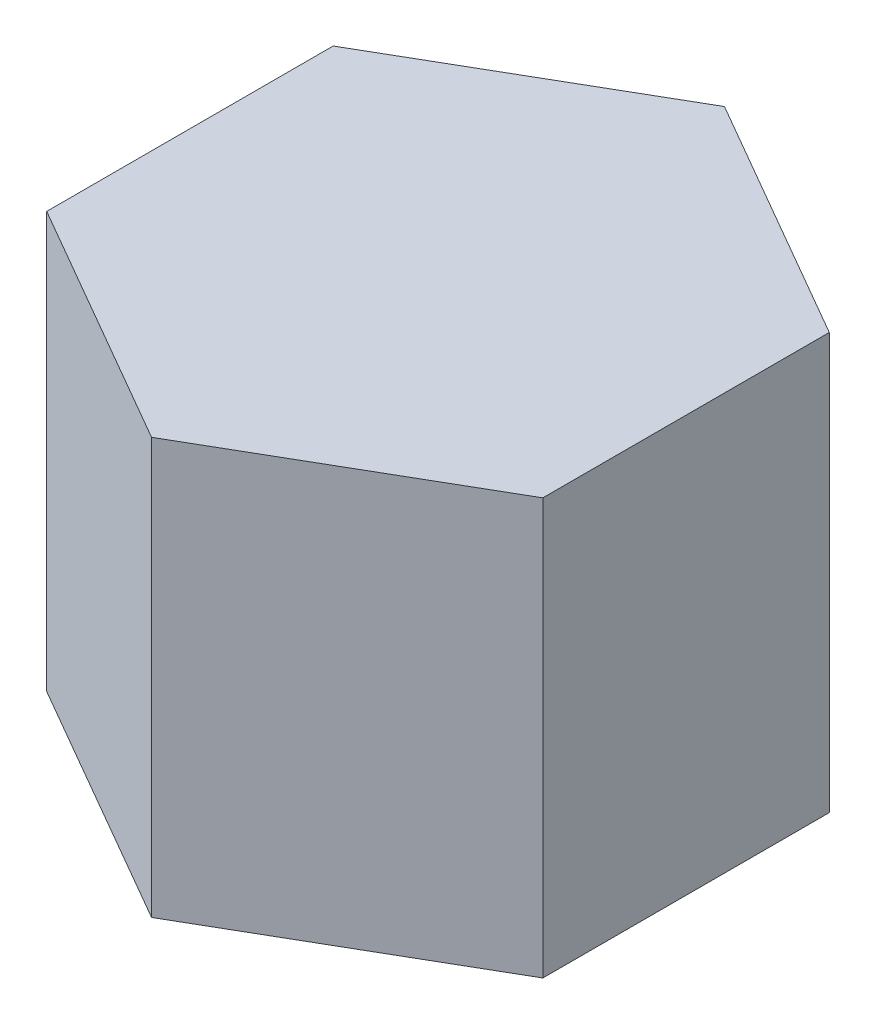
ISO-10303-21;
HEADER;
FILE_DESCRIPTION(('STEP AP214'),'2;1');
FILE_NAME('part.step','',(''),(''),'','','');
FILE_SCHEMA(('AUTOMOTIVE_DESIGN { 1 0 10303 214 1 1 1 1 }'));
ENDSEC;
DATA;
#1=APPLICATION_CONTEXT('core data for automotive mechanical design processes');
#2=APPLICATION_PROTOCOL_DEFINITION('international standard','automotive_design',2000,#1);
#3=PRODUCT_CONTEXT('',#1,'mechanical');
#4=PRODUCT('Part','Part','',(#3));
#5=PRODUCT_RELATED_PRODUCT_CATEGORY('part','',(#4));
#6=PRODUCT_DEFINITION_FORMATION('','',#4);
#7=PRODUCT_DEFINITION_CONTEXT('part definition',#1,'design');
#8=PRODUCT_DEFINITION('design','',#6,#7);
#9=PRODUCT_DEFINITION_SHAPE('','',#8);
#10=(LENGTH_UNIT() NAMED_UNIT(*) SI_UNIT(.MILLI.,.METRE.));
#11=(NAMED_UNIT(*) PLANE_ANGLE_UNIT() SI_UNIT($,.RADIAN.));
#12=(NAMED_UNIT(*) SI_UNIT($,.STERADIAN.) SOLID_ANGLE_UNIT());
#13=UNCERTAINTY_MEASURE_WITH_UNIT(LENGTH_MEASURE(1.E-05),#10,'distance_accuracy_value','');
#14=(GEOMETRIC_REPRESENTATION_CONTEXT(3) GLOBAL_UNCERTAINTY_ASSIGNED_CONTEXT((#13)) GLOBAL_UNIT_ASSIGNED_CONTEXT((#10,
#11,#12)) REPRESENTATION_CONTEXT('',''));
#15=CARTESIAN_POINT('',(0.,0.,0.));
#16=DIRECTION('',(0.,0.,1.));
#17=DIRECTION('',(1.,0.,0.));
#18=AXIS2_PLACEMENT_3D('',#15,#16,#17);
#19=CARTESIAN_POINT('',(209.142660308706,-148.537700895744,294.105047431848));
#20=DIRECTION('',(-0.499999999999909,0.,-0.866025403784491));
#21=DIRECTION('',(-0.866025403784491,0.,0.499999999999909));
#22=AXIS2_PLACEMENT_3D('',#19,#20,#21);
#23=PLANE('',#22);
#24=CARTESIAN_POINT('',(208.839551417381,-149.045793579175,294.280047431848));
#25=DIRECTION('',(0.866025403784491,0.,-0.499999999999909));
#26=VECTOR('',#25,1.);
#27=LINE('',#24,#26);
#28=CARTESIAN_POINT('',(208.839551417382,-149.045793579175,294.280047431848));
#29=VERTEX_POINT('',#28);
#30=CARTESIAN_POINT('',(209.142660308706,-149.045793579175,294.105047431848));
#31=VERTEX_POINT('',#30);
#32=EDGE_CURVE('E170',#29,#31,#27,.T.);
#33=ORIENTED_EDGE('',*,*,#32,.T.);
#34=CARTESIAN_POINT('',(209.142660308706,-148.537700895744,294.105047431848));
#35=DIRECTION('',(0.,-1.,0.));
#36=VECTOR('',#35,1.);
#37=LINE('',#34,#36);
#38=CARTESIAN_POINT('',(209.142660308706,-148.537700895744,294.105047431848));
#39=VERTEX_POINT('',#38);
#40=EDGE_CURVE('E35',#39,#31,#37,.T.);
#41=ORIENTED_EDGE('',*,*,#40,.F.);
#42=CARTESIAN_POINT('',(208.839551417381,-148.537700895744,294.280047431848));
#43=DIRECTION('',(0.866025403784491,0.,-0.499999999999909));
#44=VECTOR('',#43,1.);
#45=LINE('',#42,#44);
#46=CARTESIAN_POINT('',(208.839551417382,-148.537700895744,294.280047431848));
#47=VERTEX_POINT('',#46);
#48=EDGE_CURVE('E159',#47,#39,#45,.T.);
#49=ORIENTED_EDGE('',*,*,#48,.F.);
#50=CARTESIAN_POINT('',(208.839551417381,-148.537700895744,294.280047431848));
#51=DIRECTION('',(0.,-1.,0.));
#52=VECTOR('',#51,1.);
#53=LINE('',#50,#52);
#54=EDGE_CURVE('E10',#47,#29,#53,.T.);
#55=ORIENTED_EDGE('',*,*,#54,.T.);
#56=EDGE_LOOP('',(#33,#41,#49,#55));
#57=FACE_BOUND('',#56,.T.);
#58=ADVANCED_FACE('F16',(#57),#23,.F.);
#59=CARTESIAN_POINT('',(208.839551417382,-148.537700895744,294.280047431848));
#60=DIRECTION('',(0.500000000000062,0.,-0.866025403784403));
#61=DIRECTION('',(-0.866025403784403,0.,-0.500000000000062));
#62=AXIS2_PLACEMENT_3D('',#59,#60,#61);
#63=PLANE('',#62);
#64=CARTESIAN_POINT('',(208.536442526057,-149.045793579175,294.105047431848));
#65=DIRECTION('',(0.866025403784403,0.,0.500000000000062));
#66=VECTOR('',#65,1.);
#67=LINE('',#64,#66);
#68=CARTESIAN_POINT('',(208.536442526057,-149.045793579175,294.105047431848));
#69=VERTEX_POINT('',#68);
#70=EDGE_CURVE('E167',#69,#29,#67,.T.);
#71=ORIENTED_EDGE('',*,*,#70,.T.);
#72=ORIENTED_EDGE('',*,*,#54,.F.);
#73=CARTESIAN_POINT('',(208.536442526057,-148.537700895744,294.105047431848));
#74=DIRECTION('',(0.866025403784403,0.,0.500000000000062));
#75=VECTOR('',#74,1.);
#76=LINE('',#73,#75);
#77=CARTESIAN_POINT('',(208.536442526057,-148.537700895744,294.105047431848));
#78=VERTEX_POINT('',#77);
#79=EDGE_CURVE('E156',#78,#47,#76,.T.);
#80=ORIENTED_EDGE('',*,*,#79,.F.);
#81=CARTESIAN_POINT('',(208.536442526057,-148.537700895744,294.105047431848));
#82=DIRECTION('',(0.,-1.,0.));
#83=VECTOR('',#82,1.);
#84=LINE('',#81,#83);
#85=EDGE_CURVE('E27',#78,#69,#84,.T.);
#86=ORIENTED_EDGE('',*,*,#85,.T.);
#87=EDGE_LOOP('',(#71,#72,#80,#86));
#88=FACE_BOUND('',#87,.T.);
#89=ADVANCED_FACE('F189',(#88),#63,.F.);
#90=CARTESIAN_POINT('',(208.536442526057,-148.537700895744,290.831971220494));
#91=DIRECTION('',(1.,0.,0.));
#92=DIRECTION('',(0.,1.,0.));
#93=AXIS2_PLACEMENT_3D('',#90,#91,#92);
#94=PLANE('',#93);
#95=CARTESIAN_POINT('',(208.536442526057,-149.045793579175,293.755047431848));
#96=DIRECTION('',(0.,0.,1.));
#97=VECTOR('',#96,1.);
#98=LINE('',#95,#97);
#99=CARTESIAN_POINT('',(208.536442526057,-149.045793579175,293.755047431848));
#100=VERTEX_POINT('',#99);
#101=EDGE_CURVE('E163',#100,#69,#98,.T.);
#102=ORIENTED_EDGE('',*,*,#101,.T.);
#103=ORIENTED_EDGE('',*,*,#85,.F.);
#104=CARTESIAN_POINT('',(208.536442526057,-148.537700895744,293.755047431848));
#105=DIRECTION('',(0.,0.,1.));
#106=VECTOR('',#105,1.);
#107=LINE('',#104,#106);
#108=CARTESIAN_POINT('',(208.536442526057,-148.537700895744,293.755047431848));
#109=VERTEX_POINT('',#108);
#110=EDGE_CURVE('E106',#109,#78,#107,.T.);
#111=ORIENTED_EDGE('',*,*,#110,.F.);
#112=CARTESIAN_POINT('',(208.536442526057,-148.537700895744,293.755047431848));
#113=DIRECTION('',(0.,-1.,0.));
#114=VECTOR('',#113,1.);
#115=LINE('',#112,#114);
#116=EDGE_CURVE('E94',#109,#100,#115,.T.);
#117=ORIENTED_EDGE('',*,*,#116,.T.);
#118=EDGE_LOOP('',(#102,#103,#111,#117));
#119=FACE_BOUND('',#118,.T.);
#120=ADVANCED_FACE('F198',(#119),#94,.F.);
#121=CARTESIAN_POINT('',(208.536442526057,-148.537700895744,293.755047431848));
#122=DIRECTION('',(0.499999999999978,0.,0.866025403784452));
#123=DIRECTION('',(0.866025403784452,0.,-0.499999999999978));
#124=AXIS2_PLACEMENT_3D('',#121,#122,#123);
#125=PLANE('',#124);
#126=CARTESIAN_POINT('',(208.839551417382,-149.045793579175,293.580047431848));
#127=DIRECTION('',(-0.866025403784452,0.,0.499999999999978));
#128=VECTOR('',#127,1.);
#129=LINE('',#126,#128);
#130=CARTESIAN_POINT('',(208.839551417382,-149.045793579175,293.580047431848));
#131=VERTEX_POINT('',#130);
#132=EDGE_CURVE('E162',#131,#100,#129,.T.);
#133=ORIENTED_EDGE('',*,*,#132,.T.);
#134=ORIENTED_EDGE('',*,*,#116,.F.);
#135=CARTESIAN_POINT('',(208.839551417382,-148.537700895744,293.580047431848));
#136=DIRECTION('',(-0.866025403784452,0.,0.499999999999978));
#137=VECTOR('',#136,1.);
#138=LINE('',#135,#137);
#139=CARTESIAN_POINT('',(208.839551417382,-148.537700895744,293.580047431848));
#140=VERTEX_POINT('',#139);
#141=EDGE_CURVE('E98',#140,#109,#138,.T.);
#142=ORIENTED_EDGE('',*,*,#141,.F.);
#143=CARTESIAN_POINT('',(208.839551417382,-148.537700895744,293.580047431848));
#144=DIRECTION('',(0.,-1.,0.));
#145=VECTOR('',#144,1.);
#146=LINE('',#143,#145);
#147=EDGE_CURVE('E79',#140,#131,#146,.T.);
#148=ORIENTED_EDGE('',*,*,#147,.T.);
#149=EDGE_LOOP('',(#133,#134,#142,#148));
#150=FACE_BOUND('',#149,.T.);
#151=ADVANCED_FACE('F100',(#150),#125,.F.);
#152=CARTESIAN_POINT('',(208.839551417382,-148.537700895744,293.580047431848));
#153=DIRECTION('',(-0.500000000000062,0.,0.866025403784403));
#154=DIRECTION('',(0.866025403784403,0.,0.500000000000062));
#155=AXIS2_PLACEMENT_3D('',#152,#153,#154);
#156=PLANE('',#155);
#157=CARTESIAN_POINT('',(209.142660308706,-149.045793579175,293.755047431848));
#158=DIRECTION('',(-0.866025403784403,0.,-0.500000000000062));
#159=VECTOR('',#158,1.);
#160=LINE('',#157,#159);
#161=CARTESIAN_POINT('',(209.142660308706,-149.045793579175,293.755047431848));
#162=VERTEX_POINT('',#161);
#163=EDGE_CURVE('E88',#162,#131,#160,.T.);
#164=ORIENTED_EDGE('',*,*,#163,.T.);
#165=ORIENTED_EDGE('',*,*,#147,.F.);
#166=CARTESIAN_POINT('',(209.142660308706,-148.537700895744,293.755047431848));
#167=DIRECTION('',(-0.866025403784403,0.,-0.500000000000062));
#168=VECTOR('',#167,1.);
#169=LINE('',#166,#168);
#170=CARTESIAN_POINT('',(209.142660308706,-148.537700895744,293.755047431848));
#171=VERTEX_POINT('',#170);
#172=EDGE_CURVE('E84',#171,#140,#169,.T.);
#173=ORIENTED_EDGE('',*,*,#172,.F.);
#174=CARTESIAN_POINT('',(209.142660308706,-148.537700895744,293.755047431848));
#175=DIRECTION('',(0.,-1.,0.));
#176=VECTOR('',#175,1.);
#177=LINE('',#174,#176);
#178=EDGE_CURVE('E58',#171,#162,#177,.T.);
#179=ORIENTED_EDGE('',*,*,#178,.T.);
#180=EDGE_LOOP('',(#164,#165,#173,#179));
#181=FACE_BOUND('',#180,.T.);
#182=ADVANCED_FACE('F82',(#181),#156,.F.);
#183=CARTESIAN_POINT('',(209.142660308706,-148.537700895744,290.831971220494));
#184=DIRECTION('',(-1.,0.,0.));
#185=DIRECTION('',(0.,-1.,0.));
#186=AXIS2_PLACEMENT_3D('',#183,#184,#185);
#187=PLANE('',#186);
#188=CARTESIAN_POINT('',(209.142660308706,-149.045793579175,294.105047431848));
#189=DIRECTION('',(0.,0.,-1.));
#190=VECTOR('',#189,1.);
#191=LINE('',#188,#190);
#192=EDGE_CURVE('E160',#31,#162,#191,.T.);
#193=ORIENTED_EDGE('',*,*,#192,.T.);
#194=ORIENTED_EDGE('',*,*,#178,.F.);
#195=CARTESIAN_POINT('',(209.142660308706,-148.537700895744,294.105047431848));
#196=DIRECTION('',(0.,0.,-1.));
#197=VECTOR('',#196,1.);
#198=LINE('',#195,#197);
#199=EDGE_CURVE('E112',#39,#171,#198,.T.);
#200=ORIENTED_EDGE('',*,*,#199,.F.);
#201=ORIENTED_EDGE('',*,*,#40,.T.);
#202=EDGE_LOOP('',(#193,#194,#200,#201));
#203=FACE_BOUND('',#202,.T.);
#204=ADVANCED_FACE('F131',(#203),#187,.F.);
#205=CARTESIAN_POINT('',(206.339551417382,-148.537700895744,290.831971220494));
#206=DIRECTION('',(0.,-1.,0.));
#207=DIRECTION('',(1.,0.,0.));
#208=AXIS2_PLACEMENT_3D('',#205,#206,#207);
#209=PLANE('',#208);
#210=ORIENTED_EDGE('',*,*,#48,.T.);
#211=ORIENTED_EDGE('',*,*,#199,.T.);
#212=ORIENTED_EDGE('',*,*,#172,.T.);
#213=ORIENTED_EDGE('',*,*,#141,.T.);
#214=ORIENTED_EDGE('',*,*,#110,.T.);
#215=ORIENTED_EDGE('',*,*,#79,.T.);
#216=EDGE_LOOP('',(#210,#211,#212,#213,#214,#215));
#217=FACE_BOUND('',#216,.T.);
#218=ADVANCED_FACE('F111',(#217),#209,.F.);
#219=CARTESIAN_POINT('',(206.339551417382,-149.045793579175,290.831971220494));
#220=DIRECTION('',(0.,-1.,0.));
#221=DIRECTION('',(1.,0.,0.));
#222=AXIS2_PLACEMENT_3D('',#219,#220,#221);
#223=PLANE('',#222);
#224=ORIENTED_EDGE('',*,*,#32,.F.);
#225=ORIENTED_EDGE('',*,*,#70,.F.);
#226=ORIENTED_EDGE('',*,*,#101,.F.);
#227=ORIENTED_EDGE('',*,*,#132,.F.);
#228=ORIENTED_EDGE('',*,*,#163,.F.);
#229=ORIENTED_EDGE('',*,*,#192,.F.);
#230=EDGE_LOOP('',(#224,#225,#226,#227,#228,#229));
#231=FACE_BOUND('',#230,.T.);
#232=ADVANCED_FACE('F130',(#231),#223,.T.);
#233=CLOSED_SHELL('',(#58,#89,#120,#151,#182,#204,#218,#232));
#234=MANIFOLD_SOLID_BREP('B1',#233);
#235=ADVANCED_BREP_SHAPE_REPRESENTATION('',(#18,#234),#14);
#236=SHAPE_DEFINITION_REPRESENTATION(#9,#235);
ENDSEC;
END-ISO-10303-21;
